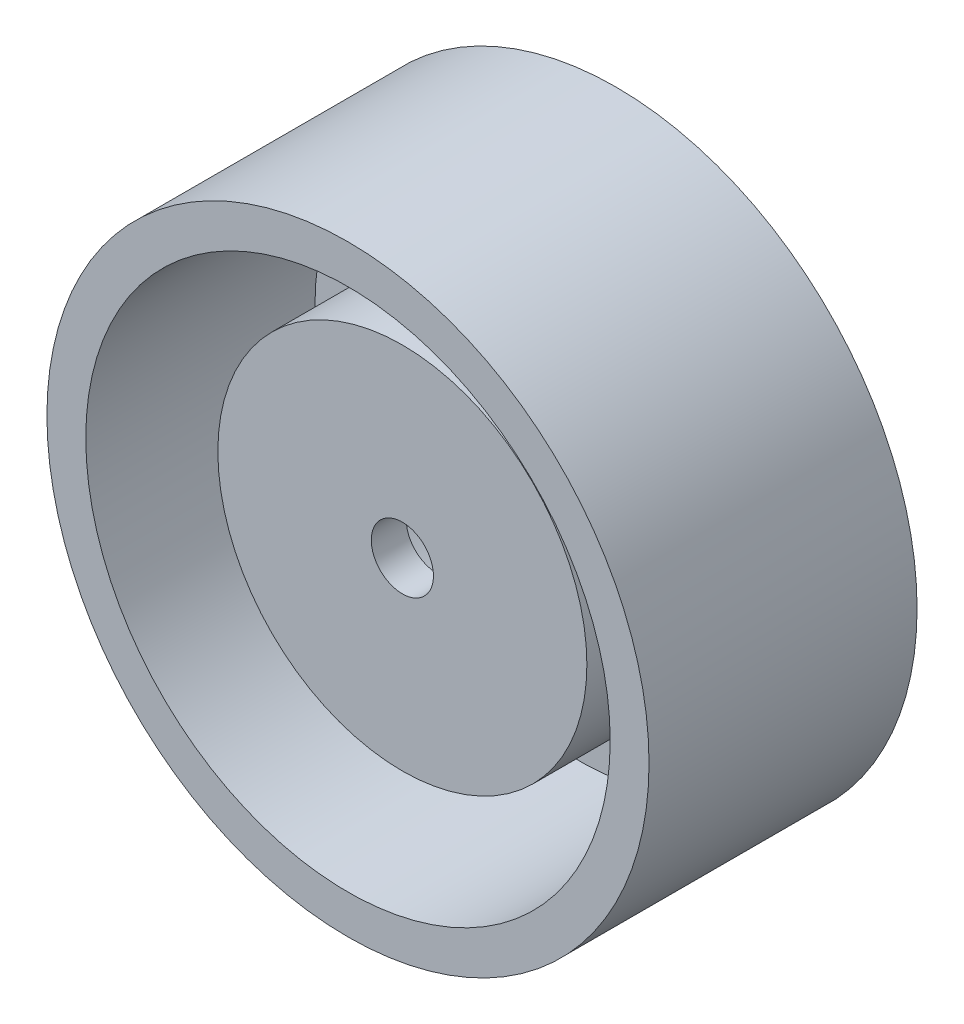
ISO-10303-21;
HEADER;
FILE_DESCRIPTION(('STEP AP214'),'2;1');
FILE_NAME('part.step','',(''),(''),'','','');
FILE_SCHEMA(('AUTOMOTIVE_DESIGN { 1 0 10303 214 1 1 1 1 }'));
ENDSEC;
DATA;
#1=APPLICATION_CONTEXT('core data for automotive mechanical design processes');
#2=APPLICATION_PROTOCOL_DEFINITION('international standard','automotive_design',2000,#1);
#3=PRODUCT_CONTEXT('',#1,'mechanical');
#4=PRODUCT('Part','Part','',(#3));
#5=PRODUCT_RELATED_PRODUCT_CATEGORY('part','',(#4));
#6=PRODUCT_DEFINITION_FORMATION('','',#4);
#7=PRODUCT_DEFINITION_CONTEXT('part definition',#1,'design');
#8=PRODUCT_DEFINITION('design','',#6,#7);
#9=PRODUCT_DEFINITION_SHAPE('','',#8);
#10=(LENGTH_UNIT() NAMED_UNIT(*) SI_UNIT(.MILLI.,.METRE.));
#11=(NAMED_UNIT(*) PLANE_ANGLE_UNIT() SI_UNIT($,.RADIAN.));
#12=(NAMED_UNIT(*) SI_UNIT($,.STERADIAN.) SOLID_ANGLE_UNIT());
#13=UNCERTAINTY_MEASURE_WITH_UNIT(LENGTH_MEASURE(1.E-05),#10,'distance_accuracy_value','');
#14=(GEOMETRIC_REPRESENTATION_CONTEXT(3) GLOBAL_UNCERTAINTY_ASSIGNED_CONTEXT((#13)) GLOBAL_UNIT_ASSIGNED_CONTEXT((#10,
#11,#12)) REPRESENTATION_CONTEXT('',''));
#15=CARTESIAN_POINT('',(0.,0.,0.));
#16=DIRECTION('',(0.,0.,1.));
#17=DIRECTION('',(1.,0.,0.));
#18=AXIS2_PLACEMENT_3D('',#15,#16,#17);
#19=CARTESIAN_POINT('',(-69.7694619066169,37.4770451805375,2.54));
#20=DIRECTION('',(0.,0.,1.));
#21=DIRECTION('',(1.,0.,0.));
#22=AXIS2_PLACEMENT_3D('',#19,#20,#21);
#23=PLANE('',#22);
#24=CARTESIAN_POINT('',(-69.7694619066169,37.4770451805375,2.54));
#25=DIRECTION('',(0.,0.,1.));
#26=DIRECTION('',(1.,0.,0.));
#27=AXIS2_PLACEMENT_3D('',#24,#25,#26);
#28=CIRCLE('',#27,17.145);
#29=CARTESIAN_POINT('',(-52.6244619066169,37.4770451805375,2.54));
#30=VERTEX_POINT('',#29);
#31=EDGE_CURVE('E47',#30,#30,#28,.T.);
#32=ORIENTED_EDGE('',*,*,#31,.T.);
#33=EDGE_LOOP('',(#32));
#34=FACE_BOUND('',#33,.T.);
#35=CARTESIAN_POINT('',(-69.7694619066169,37.4770451805375,2.54));
#36=DIRECTION('',(0.,0.,1.));
#37=DIRECTION('',(1.,0.,0.));
#38=AXIS2_PLACEMENT_3D('',#35,#36,#37);
#39=CIRCLE('',#38,12.065);
#40=CARTESIAN_POINT('',(-57.7044619066169,37.4770451805375,2.54));
#41=VERTEX_POINT('',#40);
#42=EDGE_CURVE('E51',#41,#41,#39,.T.);
#43=ORIENTED_EDGE('',*,*,#42,.F.);
#44=EDGE_LOOP('',(#43));
#45=FACE_BOUND('',#44,.T.);
#46=ADVANCED_FACE('F30',(#34,#45),#23,.T.);
#47=CARTESIAN_POINT('',(-69.7694619066169,37.4770451805375,17.526));
#48=DIRECTION('',(0.,0.,-1.));
#49=DIRECTION('',(-1.,0.,0.));
#50=AXIS2_PLACEMENT_3D('',#47,#48,#49);
#51=CYLINDRICAL_SURFACE('',#50,19.685);
#52=CARTESIAN_POINT('',(-69.7694619066169,37.4770451805375,17.526));
#53=DIRECTION('',(0.,0.,1.));
#54=DIRECTION('',(1.,0.,0.));
#55=AXIS2_PLACEMENT_3D('',#52,#53,#54);
#56=CIRCLE('',#55,19.685);
#57=CARTESIAN_POINT('',(-50.0844619066169,37.4770451805375,17.526));
#58=VERTEX_POINT('',#57);
#59=EDGE_CURVE('E10',#58,#58,#56,.T.);
#60=ORIENTED_EDGE('',*,*,#59,.F.);
#61=EDGE_LOOP('',(#60));
#62=FACE_BOUND('',#61,.T.);
#63=CARTESIAN_POINT('',(-69.7694619066169,37.4770451805375,0.));
#64=DIRECTION('',(0.,0.,1.));
#65=DIRECTION('',(1.,0.,0.));
#66=AXIS2_PLACEMENT_3D('',#63,#64,#65);
#67=CIRCLE('',#66,19.685);
#68=CARTESIAN_POINT('',(-50.0844619066169,37.4770451805375,0.));
#69=VERTEX_POINT('',#68);
#70=EDGE_CURVE('E38',#69,#69,#67,.T.);
#71=ORIENTED_EDGE('',*,*,#70,.T.);
#72=EDGE_LOOP('',(#71));
#73=FACE_BOUND('',#72,.T.);
#74=ADVANCED_FACE('F32',(#62,#73),#51,.T.);
#75=CARTESIAN_POINT('',(-69.7694619066169,37.4770451805375,17.526));
#76=DIRECTION('',(0.,0.,1.));
#77=DIRECTION('',(1.,0.,0.));
#78=AXIS2_PLACEMENT_3D('',#75,#76,#77);
#79=PLANE('',#78);
#80=CARTESIAN_POINT('',(-69.7694619066169,37.4770451805375,17.526));
#81=DIRECTION('',(0.,0.,1.));
#82=DIRECTION('',(1.,0.,0.));
#83=AXIS2_PLACEMENT_3D('',#80,#81,#82);
#84=CIRCLE('',#83,17.145);
#85=CARTESIAN_POINT('',(-52.6244619066169,37.4770451805375,17.526));
#86=VERTEX_POINT('',#85);
#87=EDGE_CURVE('E43',#86,#86,#84,.T.);
#88=ORIENTED_EDGE('',*,*,#87,.F.);
#89=EDGE_LOOP('',(#88));
#90=FACE_BOUND('',#89,.T.);
#91=ORIENTED_EDGE('',*,*,#59,.T.);
#92=EDGE_LOOP('',(#91));
#93=FACE_BOUND('',#92,.T.);
#94=ADVANCED_FACE('F88',(#90,#93),#79,.T.);
#95=CARTESIAN_POINT('',(-69.7694619066169,37.4770451805375,0.));
#96=DIRECTION('',(0.,0.,1.));
#97=DIRECTION('',(1.,0.,0.));
#98=AXIS2_PLACEMENT_3D('',#95,#96,#97);
#99=PLANE('',#98);
#100=CARTESIAN_POINT('',(-69.7694619066169,37.4770451805375,0.));
#101=DIRECTION('',(0.,0.,-1.));
#102=DIRECTION('',(-1.,0.,0.));
#103=AXIS2_PLACEMENT_3D('',#100,#101,#102);
#104=CIRCLE('',#103,10.795);
#105=CARTESIAN_POINT('',(-80.5644619066169,37.4770451805375,0.));
#106=VERTEX_POINT('',#105);
#107=EDGE_CURVE('E57',#106,#106,#104,.T.);
#108=ORIENTED_EDGE('',*,*,#107,.F.);
#109=EDGE_LOOP('',(#108));
#110=FACE_BOUND('',#109,.T.);
#111=ORIENTED_EDGE('',*,*,#70,.F.);
#112=EDGE_LOOP('',(#111));
#113=FACE_BOUND('',#112,.T.);
#114=ADVANCED_FACE('F84',(#110,#113),#99,.F.);
#115=CARTESIAN_POINT('',(-69.7694619066169,37.4770451805375,17.526));
#116=DIRECTION('',(0.,0.,-1.));
#117=DIRECTION('',(-1.,0.,0.));
#118=AXIS2_PLACEMENT_3D('',#115,#116,#117);
#119=CYLINDRICAL_SURFACE('',#118,17.145);
#120=ORIENTED_EDGE('',*,*,#87,.T.);
#121=EDGE_LOOP('',(#120));
#122=FACE_BOUND('',#121,.T.);
#123=ORIENTED_EDGE('',*,*,#31,.F.);
#124=EDGE_LOOP('',(#123));
#125=FACE_BOUND('',#124,.T.);
#126=ADVANCED_FACE('F87',(#122,#125),#119,.F.);
#127=CARTESIAN_POINT('',(-69.7694619066169,37.4770451805375,13.97));
#128=DIRECTION('',(0.,0.,-1.));
#129=DIRECTION('',(-1.,0.,0.));
#130=AXIS2_PLACEMENT_3D('',#127,#128,#129);
#131=CYLINDRICAL_SURFACE('',#130,12.065);
#132=CARTESIAN_POINT('',(-69.7694619066169,37.4770451805375,13.97));
#133=DIRECTION('',(0.,0.,1.));
#134=DIRECTION('',(1.,0.,0.));
#135=AXIS2_PLACEMENT_3D('',#132,#133,#134);
#136=CIRCLE('',#135,12.065);
#137=CARTESIAN_POINT('',(-57.7044619066169,37.4770451805375,13.97));
#138=VERTEX_POINT('',#137);
#139=EDGE_CURVE('E50',#138,#138,#136,.T.);
#140=ORIENTED_EDGE('',*,*,#139,.F.);
#141=EDGE_LOOP('',(#140));
#142=FACE_BOUND('',#141,.T.);
#143=ORIENTED_EDGE('',*,*,#42,.T.);
#144=EDGE_LOOP('',(#143));
#145=FACE_BOUND('',#144,.T.);
#146=ADVANCED_FACE('F107',(#142,#145),#131,.T.);
#147=CARTESIAN_POINT('',(-69.7694619066169,37.4770451805375,13.97));
#148=DIRECTION('',(0.,0.,1.));
#149=DIRECTION('',(1.,0.,0.));
#150=AXIS2_PLACEMENT_3D('',#147,#148,#149);
#151=PLANE('',#150);
#152=CARTESIAN_POINT('',(-69.7694619066169,37.4770451805375,13.97));
#153=DIRECTION('',(0.,0.,1.));
#154=DIRECTION('',(1.,0.,0.));
#155=AXIS2_PLACEMENT_3D('',#152,#153,#154);
#156=CIRCLE('',#155,2.03200000000001);
#157=CARTESIAN_POINT('',(-67.7374619066169,37.4770451805375,13.97));
#158=VERTEX_POINT('',#157);
#159=EDGE_CURVE('E62',#158,#158,#156,.T.);
#160=ORIENTED_EDGE('',*,*,#159,.F.);
#161=EDGE_LOOP('',(#160));
#162=FACE_BOUND('',#161,.T.);
#163=ORIENTED_EDGE('',*,*,#139,.T.);
#164=EDGE_LOOP('',(#163));
#165=FACE_BOUND('',#164,.T.);
#166=ADVANCED_FACE('F80',(#162,#165),#151,.T.);
#167=CARTESIAN_POINT('',(-69.7694619066169,37.4770451805375,11.684));
#168=DIRECTION('',(0.,0.,-1.));
#169=DIRECTION('',(-1.,0.,0.));
#170=AXIS2_PLACEMENT_3D('',#167,#168,#169);
#171=CYLINDRICAL_SURFACE('',#170,10.795);
#172=CARTESIAN_POINT('',(-69.7694619066169,37.4770451805375,11.684));
#173=DIRECTION('',(0.,0.,-1.));
#174=DIRECTION('',(-1.,0.,0.));
#175=AXIS2_PLACEMENT_3D('',#172,#173,#174);
#176=CIRCLE('',#175,10.795);
#177=CARTESIAN_POINT('',(-80.5644619066169,37.4770451805375,11.684));
#178=VERTEX_POINT('',#177);
#179=EDGE_CURVE('E54',#178,#178,#176,.T.);
#180=ORIENTED_EDGE('',*,*,#179,.F.);
#181=EDGE_LOOP('',(#180));
#182=FACE_BOUND('',#181,.T.);
#183=ORIENTED_EDGE('',*,*,#107,.T.);
#184=EDGE_LOOP('',(#183));
#185=FACE_BOUND('',#184,.T.);
#186=ADVANCED_FACE('F74',(#182,#185),#171,.F.);
#187=CARTESIAN_POINT('',(-69.7694619066169,37.4770451805375,11.684));
#188=DIRECTION('',(0.,0.,-1.));
#189=DIRECTION('',(-1.,0.,0.));
#190=AXIS2_PLACEMENT_3D('',#187,#188,#189);
#191=PLANE('',#190);
#192=CARTESIAN_POINT('',(-69.7694619066169,37.4770451805375,11.684));
#193=DIRECTION('',(0.,0.,-1.));
#194=DIRECTION('',(-1.,0.,0.));
#195=AXIS2_PLACEMENT_3D('',#192,#193,#194);
#196=CIRCLE('',#195,2.03200000000001);
#197=CARTESIAN_POINT('',(-71.8014619066169,37.4770451805375,11.684));
#198=VERTEX_POINT('',#197);
#199=EDGE_CURVE('E34',#198,#198,#196,.T.);
#200=ORIENTED_EDGE('',*,*,#199,.F.);
#201=EDGE_LOOP('',(#200));
#202=FACE_BOUND('',#201,.T.);
#203=ORIENTED_EDGE('',*,*,#179,.T.);
#204=EDGE_LOOP('',(#203));
#205=FACE_BOUND('',#204,.T.);
#206=ADVANCED_FACE('F71',(#202,#205),#191,.T.);
#207=CARTESIAN_POINT('',(-69.7694619066169,37.4770451805375,11.43));
#208=DIRECTION('',(0.,0.,1.));
#209=DIRECTION('',(1.,0.,0.));
#210=AXIS2_PLACEMENT_3D('',#207,#208,#209);
#211=CYLINDRICAL_SURFACE('',#210,2.03200000000001);
#212=ORIENTED_EDGE('',*,*,#199,.T.);
#213=EDGE_LOOP('',(#212));
#214=FACE_BOUND('',#213,.T.);
#215=ORIENTED_EDGE('',*,*,#159,.T.);
#216=EDGE_LOOP('',(#215));
#217=FACE_BOUND('',#216,.T.);
#218=ADVANCED_FACE('F69',(#214,#217),#211,.F.);
#219=CLOSED_SHELL('',(#46,#74,#94,#114,#126,#146,#166,#186,#206,#218));
#220=MANIFOLD_SOLID_BREP('B2',#219);
#221=ADVANCED_BREP_SHAPE_REPRESENTATION('',(#18,#220),#14);
#222=SHAPE_DEFINITION_REPRESENTATION(#9,#221);
ENDSEC;
END-ISO-10303-21;
